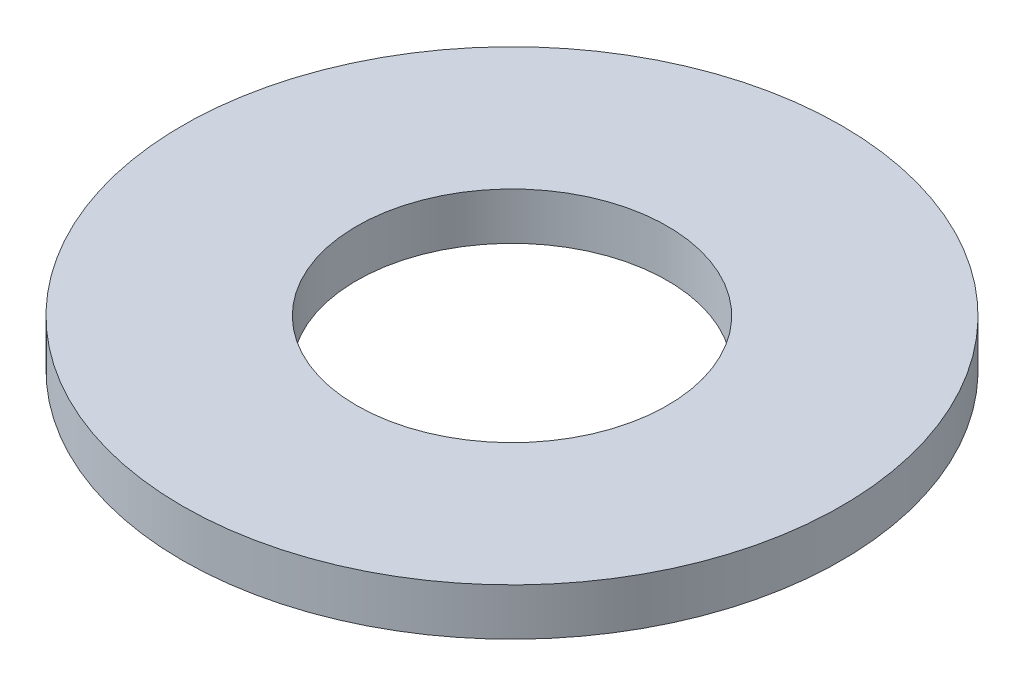
ISO-10303-21;
HEADER;
FILE_DESCRIPTION(('STEP AP214'),'2;1');
FILE_NAME('part.step','',(''),(''),'','','');
FILE_SCHEMA(('AUTOMOTIVE_DESIGN { 1 0 10303 214 1 1 1 1 }'));
ENDSEC;
DATA;
#1=APPLICATION_CONTEXT('core data for automotive mechanical design processes');
#2=APPLICATION_PROTOCOL_DEFINITION('international standard','automotive_design',2000,#1);
#3=PRODUCT_CONTEXT('',#1,'mechanical');
#4=PRODUCT('Part','Part','',(#3));
#5=PRODUCT_RELATED_PRODUCT_CATEGORY('part','',(#4));
#6=PRODUCT_DEFINITION_FORMATION('','',#4);
#7=PRODUCT_DEFINITION_CONTEXT('part definition',#1,'design');
#8=PRODUCT_DEFINITION('design','',#6,#7);
#9=PRODUCT_DEFINITION_SHAPE('','',#8);
#10=(LENGTH_UNIT() NAMED_UNIT(*) SI_UNIT(.MILLI.,.METRE.));
#11=(NAMED_UNIT(*) PLANE_ANGLE_UNIT() SI_UNIT($,.RADIAN.));
#12=(NAMED_UNIT(*) SI_UNIT($,.STERADIAN.) SOLID_ANGLE_UNIT());
#13=UNCERTAINTY_MEASURE_WITH_UNIT(LENGTH_MEASURE(1.E-05),#10,'distance_accuracy_value','');
#14=(GEOMETRIC_REPRESENTATION_CONTEXT(3) GLOBAL_UNCERTAINTY_ASSIGNED_CONTEXT((#13)) GLOBAL_UNIT_ASSIGNED_CONTEXT((#10,
#11,#12)) REPRESENTATION_CONTEXT('',''));
#15=CARTESIAN_POINT('',(0.,0.,0.));
#16=DIRECTION('',(0.,0.,1.));
#17=DIRECTION('',(1.,0.,0.));
#18=AXIS2_PLACEMENT_3D('',#15,#16,#17);
#19=CARTESIAN_POINT('',(0.,0.5,0.));
#20=DIRECTION('',(0.,1.,0.));
#21=DIRECTION('',(0.,0.,1.));
#22=AXIS2_PLACEMENT_3D('',#19,#20,#21);
#23=PLANE('',#22);
#24=CARTESIAN_POINT('',(0.,0.5,0.));
#25=DIRECTION('',(0.,1.,0.));
#26=DIRECTION('',(0.,0.,1.));
#27=AXIS2_PLACEMENT_3D('',#24,#25,#26);
#28=CIRCLE('',#27,3.5);
#29=CARTESIAN_POINT('',(0.,0.5,3.5));
#30=VERTEX_POINT('',#29);
#31=EDGE_CURVE('E10',#30,#30,#28,.T.);
#32=ORIENTED_EDGE('',*,*,#31,.T.);
#33=EDGE_LOOP('',(#32));
#34=FACE_BOUND('',#33,.T.);
#35=CARTESIAN_POINT('',(0.,0.5,0.));
#36=DIRECTION('',(0.,1.,0.));
#37=DIRECTION('',(0.,0.,1.));
#38=AXIS2_PLACEMENT_3D('',#35,#36,#37);
#39=CIRCLE('',#38,1.65);
#40=CARTESIAN_POINT('',(0.,0.5,1.65));
#41=VERTEX_POINT('',#40);
#42=EDGE_CURVE('E42',#41,#41,#39,.T.);
#43=ORIENTED_EDGE('',*,*,#42,.F.);
#44=EDGE_LOOP('',(#43));
#45=FACE_BOUND('',#44,.T.);
#46=ADVANCED_FACE('F31',(#34,#45),#23,.T.);
#47=CARTESIAN_POINT('',(0.,0.,0.));
#48=DIRECTION('',(0.,1.,0.));
#49=DIRECTION('',(0.,0.,1.));
#50=AXIS2_PLACEMENT_3D('',#47,#48,#49);
#51=PLANE('',#50);
#52=CARTESIAN_POINT('',(0.,0.,0.));
#53=DIRECTION('',(0.,1.,0.));
#54=DIRECTION('',(0.,0.,1.));
#55=AXIS2_PLACEMENT_3D('',#52,#53,#54);
#56=CIRCLE('',#55,3.5);
#57=CARTESIAN_POINT('',(0.,0.,3.5));
#58=VERTEX_POINT('',#57);
#59=EDGE_CURVE('E35',#58,#58,#56,.T.);
#60=ORIENTED_EDGE('',*,*,#59,.F.);
#61=EDGE_LOOP('',(#60));
#62=FACE_BOUND('',#61,.T.);
#63=CARTESIAN_POINT('',(0.,0.,0.));
#64=DIRECTION('',(0.,1.,0.));
#65=DIRECTION('',(0.,0.,1.));
#66=AXIS2_PLACEMENT_3D('',#63,#64,#65);
#67=CIRCLE('',#66,1.65);
#68=CARTESIAN_POINT('',(0.,0.,1.65));
#69=VERTEX_POINT('',#68);
#70=EDGE_CURVE('E44',#69,#69,#67,.T.);
#71=ORIENTED_EDGE('',*,*,#70,.T.);
#72=EDGE_LOOP('',(#71));
#73=FACE_BOUND('',#72,.T.);
#74=ADVANCED_FACE('F54',(#62,#73),#51,.F.);
#75=CARTESIAN_POINT('',(0.,0.5,0.));
#76=DIRECTION('',(0.,-1.,0.));
#77=DIRECTION('',(0.,0.,-1.));
#78=AXIS2_PLACEMENT_3D('',#75,#76,#77);
#79=CYLINDRICAL_SURFACE('',#78,3.5);
#80=ORIENTED_EDGE('',*,*,#31,.F.);
#81=EDGE_LOOP('',(#80));
#82=FACE_BOUND('',#81,.T.);
#83=ORIENTED_EDGE('',*,*,#59,.T.);
#84=EDGE_LOOP('',(#83));
#85=FACE_BOUND('',#84,.T.);
#86=ADVANCED_FACE('F33',(#82,#85),#79,.T.);
#87=CARTESIAN_POINT('',(0.,0.5,0.));
#88=DIRECTION('',(0.,-1.,0.));
#89=DIRECTION('',(0.,0.,-1.));
#90=AXIS2_PLACEMENT_3D('',#87,#88,#89);
#91=CYLINDRICAL_SURFACE('',#90,1.65);
#92=ORIENTED_EDGE('',*,*,#42,.T.);
#93=EDGE_LOOP('',(#92));
#94=FACE_BOUND('',#93,.T.);
#95=ORIENTED_EDGE('',*,*,#70,.F.);
#96=EDGE_LOOP('',(#95));
#97=FACE_BOUND('',#96,.T.);
#98=ADVANCED_FACE('F50',(#94,#97),#91,.F.);
#99=CLOSED_SHELL('',(#46,#74,#86,#98));
#100=MANIFOLD_SOLID_BREP('B2',#99);
#101=ADVANCED_BREP_SHAPE_REPRESENTATION('',(#18,#100),#14);
#102=SHAPE_DEFINITION_REPRESENTATION(#9,#101);
ENDSEC;
END-ISO-10303-21;
